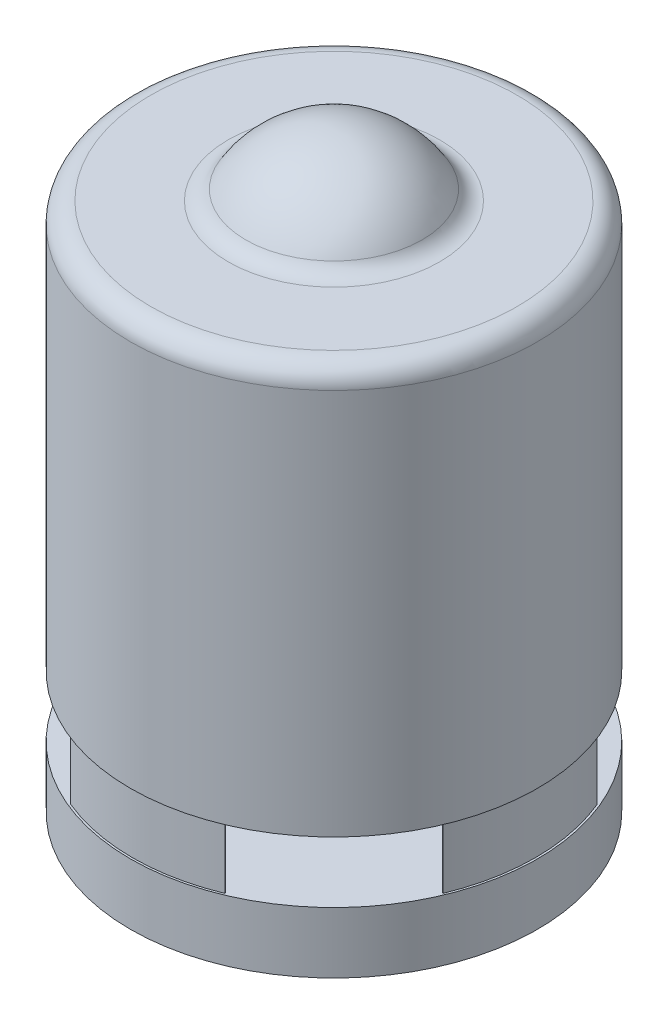
ISO-10303-21;
HEADER;
FILE_DESCRIPTION(('STEP AP214'),'2;1');
FILE_NAME('part.step','',(''),(''),'','','');
FILE_SCHEMA(('AUTOMOTIVE_DESIGN { 1 0 10303 214 1 1 1 1 }'));
ENDSEC;
DATA;
#1=APPLICATION_CONTEXT('core data for automotive mechanical design processes');
#2=APPLICATION_PROTOCOL_DEFINITION('international standard','automotive_design',2000,#1);
#3=PRODUCT_CONTEXT('',#1,'mechanical');
#4=PRODUCT('Part','Part','',(#3));
#5=PRODUCT_RELATED_PRODUCT_CATEGORY('part','',(#4));
#6=PRODUCT_DEFINITION_FORMATION('','',#4);
#7=PRODUCT_DEFINITION_CONTEXT('part definition',#1,'design');
#8=PRODUCT_DEFINITION('design','',#6,#7);
#9=PRODUCT_DEFINITION_SHAPE('','',#8);
#10=(LENGTH_UNIT() NAMED_UNIT(*) SI_UNIT(.MILLI.,.METRE.));
#11=(NAMED_UNIT(*) PLANE_ANGLE_UNIT() SI_UNIT($,.RADIAN.));
#12=(NAMED_UNIT(*) SI_UNIT($,.STERADIAN.) SOLID_ANGLE_UNIT());
#13=UNCERTAINTY_MEASURE_WITH_UNIT(LENGTH_MEASURE(1.E-05),#10,'distance_accuracy_value','');
#14=(GEOMETRIC_REPRESENTATION_CONTEXT(3) GLOBAL_UNCERTAINTY_ASSIGNED_CONTEXT((#13)) GLOBAL_UNIT_ASSIGNED_CONTEXT((#10,
#11,#12)) REPRESENTATION_CONTEXT('',''));
#15=CARTESIAN_POINT('',(0.,0.,0.));
#16=DIRECTION('',(0.,0.,1.));
#17=DIRECTION('',(1.,0.,0.));
#18=AXIS2_PLACEMENT_3D('',#15,#16,#17);
#19=CARTESIAN_POINT('',(0.,116.513033548159,0.));
#20=DIRECTION('',(0.,1.,0.));
#21=DIRECTION('',(0.,0.,1.));
#22=AXIS2_PLACEMENT_3D('',#19,#20,#21);
#23=PLANE('',#22);
#24=CARTESIAN_POINT('',(0.,116.513033548159,0.));
#25=DIRECTION('',(0.,1.,0.));
#26=DIRECTION('',(0.,0.,1.));
#27=AXIS2_PLACEMENT_3D('',#24,#25,#26);
#28=CIRCLE('',#27,23.3333333333333);
#29=CARTESIAN_POINT('',(0.,116.513033548159,23.3333333333333));
#30=VERTEX_POINT('',#29);
#31=EDGE_CURVE('E336',#30,#30,#28,.T.);
#32=ORIENTED_EDGE('',*,*,#31,.T.);
#33=EDGE_LOOP('',(#32));
#34=FACE_BOUND('',#33,.T.);
#35=DIRECTION('',(-0.923879532511296,0.,0.382683432365067));
#36=VECTOR('',#35,1.);
#37=CARTESIAN_POINT('',(21.3416172010107,116.513033548159,-8.83998728763359));
#38=LINE('',#37,#36);
#39=CARTESIAN_POINT('',(21.3416172010107,116.513033548159,-8.83998728763359));
#40=VERTEX_POINT('',#39);
#41=CARTESIAN_POINT('',(21.2338312555511,116.513033548159,-8.795340887191));
#42=VERTEX_POINT('',#41);
#43=EDGE_CURVE('E313',#40,#42,#38,.T.);
#44=ORIENTED_EDGE('',*,*,#43,.F.);
#45=CARTESIAN_POINT('',(0.,116.513033548159,0.));
#46=DIRECTION('',(0.,1.,0.));
#47=DIRECTION('',(0.,0.,-1.));
#48=AXIS2_PLACEMENT_3D('',#45,#46,#47);
#49=CIRCLE('',#48,23.1);
#50=CARTESIAN_POINT('',(21.3416172010108,116.513033548159,8.83998728763344));
#51=VERTEX_POINT('',#50);
#52=EDGE_CURVE('E291',#51,#40,#49,.T.);
#53=ORIENTED_EDGE('',*,*,#52,.F.);
#54=DIRECTION('',(0.923879532511282,0.,0.382683432365102));
#55=VECTOR('',#54,1.);
#56=CARTESIAN_POINT('',(21.3416172010108,116.513033548159,8.83998728763344));
#57=LINE('',#56,#55);
#58=CARTESIAN_POINT('',(21.2338312555511,116.513033548159,8.79534088719085));
#59=VERTEX_POINT('',#58);
#60=EDGE_CURVE('E297',#59,#51,#57,.T.);
#61=ORIENTED_EDGE('',*,*,#60,.F.);
#62=CARTESIAN_POINT('',(0.,116.513033548159,0.));
#63=DIRECTION('',(0.,-1.,0.));
#64=DIRECTION('',(0.,0.,-1.));
#65=AXIS2_PLACEMENT_3D('',#62,#63,#64);
#66=CIRCLE('',#65,22.9833333333333);
#67=EDGE_CURVE('E316',#42,#59,#66,.T.);
#68=ORIENTED_EDGE('',*,*,#67,.F.);
#69=EDGE_LOOP('',(#44,#53,#61,#68));
#70=FACE_BOUND('',#69,.T.);
#71=DIRECTION('',(-0.382683432365057,0.,-0.9238795325113));
#72=VECTOR('',#71,1.);
#73=CARTESIAN_POINT('',(8.83998728763351,116.513033548159,21.3416172010107));
#74=LINE('',#73,#72);
#75=CARTESIAN_POINT('',(8.83998728763351,116.513033548159,21.3416172010107));
#76=VERTEX_POINT('',#75);
#77=CARTESIAN_POINT('',(8.79534088719092,116.513033548159,21.2338312555511));
#78=VERTEX_POINT('',#77);
#79=EDGE_CURVE('E269',#76,#78,#74,.T.);
#80=ORIENTED_EDGE('',*,*,#79,.F.);
#81=CARTESIAN_POINT('',(0.,116.513033548159,0.));
#82=DIRECTION('',(0.,1.,0.));
#83=DIRECTION('',(0.,0.,-1.));
#84=AXIS2_PLACEMENT_3D('',#81,#82,#83);
#85=CIRCLE('',#84,23.1);
#86=CARTESIAN_POINT('',(-8.83998728763352,116.513033548159,21.3416172010107));
#87=VERTEX_POINT('',#86);
#88=EDGE_CURVE('E247',#87,#76,#85,.T.);
#89=ORIENTED_EDGE('',*,*,#88,.F.);
#90=DIRECTION('',(-0.382683432365112,0.,0.923879532511277));
#91=VECTOR('',#90,1.);
#92=CARTESIAN_POINT('',(-8.83998728763352,116.513033548159,21.3416172010107));
#93=LINE('',#92,#91);
#94=CARTESIAN_POINT('',(-8.79534088719092,116.513033548159,21.2338312555511));
#95=VERTEX_POINT('',#94);
#96=EDGE_CURVE('E253',#95,#87,#93,.T.);
#97=ORIENTED_EDGE('',*,*,#96,.F.);
#98=CARTESIAN_POINT('',(0.,116.513033548159,0.));
#99=DIRECTION('',(0.,-1.,0.));
#100=DIRECTION('',(0.,0.,-1.));
#101=AXIS2_PLACEMENT_3D('',#98,#99,#100);
#102=CIRCLE('',#101,22.9833333333333);
#103=EDGE_CURVE('E272',#78,#95,#102,.T.);
#104=ORIENTED_EDGE('',*,*,#103,.F.);
#105=EDGE_LOOP('',(#80,#89,#97,#104));
#106=FACE_BOUND('',#105,.T.);
#107=DIRECTION('',(0.923879532511296,0.,-0.382683432365067));
#108=VECTOR('',#107,1.);
#109=CARTESIAN_POINT('',(-21.3416172010108,116.513033548159,8.83998728763344));
#110=LINE('',#109,#108);
#111=CARTESIAN_POINT('',(-21.3416172010108,116.513033548159,8.83998728763344));
#112=VERTEX_POINT('',#111);
#113=CARTESIAN_POINT('',(-21.2338312555511,116.513033548159,8.79534088719085));
#114=VERTEX_POINT('',#113);
#115=EDGE_CURVE('E227',#112,#114,#110,.T.);
#116=ORIENTED_EDGE('',*,*,#115,.F.);
#117=CARTESIAN_POINT('',(0.,116.513033548159,0.));
#118=DIRECTION('',(0.,1.,0.));
#119=DIRECTION('',(0.,0.,-1.));
#120=AXIS2_PLACEMENT_3D('',#117,#118,#119);
#121=CIRCLE('',#120,23.1);
#122=CARTESIAN_POINT('',(-21.3416172010107,116.513033548159,-8.83998728763359));
#123=VERTEX_POINT('',#122);
#124=EDGE_CURVE('E205',#123,#112,#121,.T.);
#125=ORIENTED_EDGE('',*,*,#124,.F.);
#126=DIRECTION('',(-0.923879532511282,0.,-0.382683432365102));
#127=VECTOR('',#126,1.);
#128=CARTESIAN_POINT('',(-21.3416172010107,116.513033548159,-8.83998728763359));
#129=LINE('',#128,#127);
#130=CARTESIAN_POINT('',(-21.2338312555511,116.513033548159,-8.795340887191));
#131=VERTEX_POINT('',#130);
#132=EDGE_CURVE('E211',#131,#123,#129,.T.);
#133=ORIENTED_EDGE('',*,*,#132,.F.);
#134=CARTESIAN_POINT('',(0.,116.513033548159,0.));
#135=DIRECTION('',(0.,-1.,0.));
#136=DIRECTION('',(0.,0.,-1.));
#137=AXIS2_PLACEMENT_3D('',#134,#135,#136);
#138=CIRCLE('',#137,22.9833333333333);
#139=EDGE_CURVE('E230',#114,#131,#138,.T.);
#140=ORIENTED_EDGE('',*,*,#139,.F.);
#141=EDGE_LOOP('',(#116,#125,#133,#140));
#142=FACE_BOUND('',#141,.T.);
#143=DIRECTION('',(0.382683432365045,0.,0.923879532511305));
#144=VECTOR('',#143,1.);
#145=CARTESIAN_POINT('',(-8.83998728763337,116.513033548159,-21.3416172010108));
#146=LINE('',#145,#144);
#147=CARTESIAN_POINT('',(-8.83998728763337,116.513033548159,-21.3416172010108));
#148=VERTEX_POINT('',#147);
#149=CARTESIAN_POINT('',(-8.79534088719078,116.513033548159,-21.2338312555512));
#150=VERTEX_POINT('',#149);
#151=EDGE_CURVE('E188',#148,#150,#146,.T.);
#152=ORIENTED_EDGE('',*,*,#151,.F.);
#153=CARTESIAN_POINT('',(0.,116.513033548159,0.));
#154=DIRECTION('',(0.,1.,0.));
#155=DIRECTION('',(0.,0.,-1.));
#156=AXIS2_PLACEMENT_3D('',#153,#154,#155);
#157=CIRCLE('',#156,23.1);
#158=CARTESIAN_POINT('',(8.83998728763366,116.513033548159,-21.3416172010107));
#159=VERTEX_POINT('',#158);
#160=EDGE_CURVE('E185',#159,#148,#157,.T.);
#161=ORIENTED_EDGE('',*,*,#160,.F.);
#162=DIRECTION('',(0.382683432365124,0.,-0.923879532511272));
#163=VECTOR('',#162,1.);
#164=CARTESIAN_POINT('',(8.83998728763366,116.513033548159,-21.3416172010107));
#165=LINE('',#164,#163);
#166=CARTESIAN_POINT('',(8.79534088719107,116.513033548159,-21.233831255551));
#167=VERTEX_POINT('',#166);
#168=EDGE_CURVE('E167',#167,#159,#165,.T.);
#169=ORIENTED_EDGE('',*,*,#168,.F.);
#170=CARTESIAN_POINT('',(0.,116.513033548159,0.));
#171=DIRECTION('',(0.,-1.,0.));
#172=DIRECTION('',(0.,0.,-1.));
#173=AXIS2_PLACEMENT_3D('',#170,#171,#172);
#174=CIRCLE('',#173,22.9833333333333);
#175=EDGE_CURVE('E192',#150,#167,#174,.T.);
#176=ORIENTED_EDGE('',*,*,#175,.F.);
#177=EDGE_LOOP('',(#152,#161,#169,#176));
#178=FACE_BOUND('',#177,.T.);
#179=ADVANCED_FACE('F40',(#34,#70,#106,#142,#178),#23,.T.);
#180=CARTESIAN_POINT('',(0.,116.513033548159,0.));
#181=DIRECTION('',(0.,-1.,0.));
#182=DIRECTION('',(0.,0.,-1.));
#183=AXIS2_PLACEMENT_3D('',#180,#181,#182);
#184=CYLINDRICAL_SURFACE('',#183,23.3333333333333);
#185=ORIENTED_EDGE('',*,*,#31,.F.);
#186=EDGE_LOOP('',(#185));
#187=FACE_BOUND('',#186,.T.);
#188=CARTESIAN_POINT('',(0.,109.513033548159,0.));
#189=DIRECTION('',(0.,1.,0.));
#190=DIRECTION('',(0.,0.,1.));
#191=AXIS2_PLACEMENT_3D('',#188,#189,#190);
#192=CIRCLE('',#191,23.3333333333333);
#193=CARTESIAN_POINT('',(0.,109.513033548159,23.3333333333333));
#194=VERTEX_POINT('',#193);
#195=EDGE_CURVE('E335',#194,#194,#192,.T.);
#196=ORIENTED_EDGE('',*,*,#195,.T.);
#197=EDGE_LOOP('',(#196));
#198=FACE_BOUND('',#197,.T.);
#199=ADVANCED_FACE('F378',(#187,#198),#184,.T.);
#200=CARTESIAN_POINT('',(0.,109.513033548159,0.));
#201=DIRECTION('',(0.,1.,0.));
#202=DIRECTION('',(0.,0.,1.));
#203=AXIS2_PLACEMENT_3D('',#200,#201,#202);
#204=PLANE('',#203);
#205=ORIENTED_EDGE('',*,*,#195,.F.);
#206=EDGE_LOOP('',(#205));
#207=FACE_BOUND('',#206,.T.);
#208=ADVANCED_FACE('F384',(#207),#204,.F.);
#209=CARTESIAN_POINT('',(0.,123.513033548159,0.));
#210=DIRECTION('',(0.,-1.,0.));
#211=DIRECTION('',(0.,0.,-1.));
#212=AXIS2_PLACEMENT_3D('',#209,#210,#211);
#213=CYLINDRICAL_SURFACE('',#212,23.1);
#214=ORIENTED_EDGE('',*,*,#52,.T.);
#215=DIRECTION('',(0.,-1.,0.));
#216=VECTOR('',#215,1.);
#217=CARTESIAN_POINT('',(21.3416172010107,123.513033548159,-8.83998728763359));
#218=LINE('',#217,#216);
#219=CARTESIAN_POINT('',(21.3416172010107,123.513033548159,-8.83998728763359));
#220=VERTEX_POINT('',#219);
#221=EDGE_CURVE('E332',#220,#40,#218,.T.);
#222=ORIENTED_EDGE('',*,*,#221,.F.);
#223=CARTESIAN_POINT('',(0.,123.513033548159,0.));
#224=DIRECTION('',(0.,1.,0.));
#225=DIRECTION('',(0.,0.,-1.));
#226=AXIS2_PLACEMENT_3D('',#223,#224,#225);
#227=CIRCLE('',#226,23.1);
#228=CARTESIAN_POINT('',(21.3416172010108,123.513033548159,8.83998728763344));
#229=VERTEX_POINT('',#228);
#230=EDGE_CURVE('E292',#229,#220,#227,.T.);
#231=ORIENTED_EDGE('',*,*,#230,.F.);
#232=DIRECTION('',(0.,-1.,0.));
#233=VECTOR('',#232,1.);
#234=CARTESIAN_POINT('',(21.3416172010108,123.513033548159,8.83998728763344));
#235=LINE('',#234,#233);
#236=EDGE_CURVE('E309',#229,#51,#235,.T.);
#237=ORIENTED_EDGE('',*,*,#236,.T.);
#238=EDGE_LOOP('',(#214,#222,#231,#237));
#239=FACE_BOUND('',#238,.T.);
#240=ADVANCED_FACE('F390',(#239),#213,.T.);
#241=CARTESIAN_POINT('',(21.3416172010107,123.513033548159,-8.83998728763359));
#242=DIRECTION('',(0.382683432365067,0.,0.923879532511296));
#243=DIRECTION('',(0.923879532511296,0.,-0.382683432365067));
#244=AXIS2_PLACEMENT_3D('',#241,#242,#243);
#245=PLANE('',#244);
#246=ORIENTED_EDGE('',*,*,#43,.T.);
#247=DIRECTION('',(0.,-1.,0.));
#248=VECTOR('',#247,1.);
#249=CARTESIAN_POINT('',(21.2338312555511,123.513033548159,-8.795340887191));
#250=LINE('',#249,#248);
#251=CARTESIAN_POINT('',(21.2338312555511,123.513033548159,-8.795340887191));
#252=VERTEX_POINT('',#251);
#253=EDGE_CURVE('E328',#252,#42,#250,.T.);
#254=ORIENTED_EDGE('',*,*,#253,.F.);
#255=DIRECTION('',(-0.923879532511296,0.,0.382683432365067));
#256=VECTOR('',#255,1.);
#257=CARTESIAN_POINT('',(21.3416172010107,123.513033548159,-8.83998728763359));
#258=LINE('',#257,#256);
#259=EDGE_CURVE('E296',#220,#252,#258,.T.);
#260=ORIENTED_EDGE('',*,*,#259,.F.);
#261=ORIENTED_EDGE('',*,*,#221,.T.);
#262=EDGE_LOOP('',(#246,#254,#260,#261));
#263=FACE_BOUND('',#262,.T.);
#264=ADVANCED_FACE('F397',(#263),#245,.F.);
#265=CARTESIAN_POINT('',(0.,123.513033548159,0.));
#266=DIRECTION('',(0.,-1.,0.));
#267=DIRECTION('',(0.,0.,-1.));
#268=AXIS2_PLACEMENT_3D('',#265,#266,#267);
#269=CYLINDRICAL_SURFACE('',#268,22.9833333333333);
#270=ORIENTED_EDGE('',*,*,#67,.T.);
#271=DIRECTION('',(0.,-1.,0.));
#272=VECTOR('',#271,1.);
#273=CARTESIAN_POINT('',(21.2338312555511,123.513033548159,8.79534088719084));
#274=LINE('',#273,#272);
#275=CARTESIAN_POINT('',(21.2338312555511,123.513033548159,8.79534088719084));
#276=VERTEX_POINT('',#275);
#277=EDGE_CURVE('E325',#276,#59,#274,.T.);
#278=ORIENTED_EDGE('',*,*,#277,.F.);
#279=CARTESIAN_POINT('',(0.,123.513033548159,0.));
#280=DIRECTION('',(0.,-1.,0.));
#281=DIRECTION('',(0.,0.,-1.));
#282=AXIS2_PLACEMENT_3D('',#279,#280,#281);
#283=CIRCLE('',#282,22.9833333333333);
#284=EDGE_CURVE('E301',#252,#276,#283,.T.);
#285=ORIENTED_EDGE('',*,*,#284,.F.);
#286=ORIENTED_EDGE('',*,*,#253,.T.);
#287=EDGE_LOOP('',(#270,#278,#285,#286));
#288=FACE_BOUND('',#287,.T.);
#289=ADVANCED_FACE('F404',(#288),#269,.F.);
#290=CARTESIAN_POINT('',(21.3416172010108,123.513033548159,8.83998728763344));
#291=DIRECTION('',(0.382683432365102,0.,-0.923879532511281));
#292=DIRECTION('',(-0.923879532511282,0.,-0.382683432365103));
#293=AXIS2_PLACEMENT_3D('',#290,#291,#292);
#294=PLANE('',#293);
#295=ORIENTED_EDGE('',*,*,#60,.T.);
#296=ORIENTED_EDGE('',*,*,#236,.F.);
#297=DIRECTION('',(0.923879532511282,0.,0.382683432365102));
#298=VECTOR('',#297,1.);
#299=CARTESIAN_POINT('',(21.3416172010108,123.513033548159,8.83998728763344));
#300=LINE('',#299,#298);
#301=EDGE_CURVE('E305',#276,#229,#300,.T.);
#302=ORIENTED_EDGE('',*,*,#301,.F.);
#303=ORIENTED_EDGE('',*,*,#277,.T.);
#304=EDGE_LOOP('',(#295,#296,#302,#303));
#305=FACE_BOUND('',#304,.T.);
#306=ADVANCED_FACE('F418',(#305),#294,.F.);
#307=CARTESIAN_POINT('',(0.,123.513033548159,0.));
#308=DIRECTION('',(0.,-1.,0.));
#309=DIRECTION('',(0.,0.,-1.));
#310=AXIS2_PLACEMENT_3D('',#307,#308,#309);
#311=CYLINDRICAL_SURFACE('',#310,23.1);
#312=ORIENTED_EDGE('',*,*,#88,.T.);
#313=DIRECTION('',(0.,-1.,0.));
#314=VECTOR('',#313,1.);
#315=CARTESIAN_POINT('',(8.83998728763351,123.513033548159,21.3416172010107));
#316=LINE('',#315,#314);
#317=CARTESIAN_POINT('',(8.83998728763351,123.513033548159,21.3416172010107));
#318=VERTEX_POINT('',#317);
#319=EDGE_CURVE('E288',#318,#76,#316,.T.);
#320=ORIENTED_EDGE('',*,*,#319,.F.);
#321=CARTESIAN_POINT('',(0.,123.513033548159,0.));
#322=DIRECTION('',(0.,1.,0.));
#323=DIRECTION('',(0.,0.,-1.));
#324=AXIS2_PLACEMENT_3D('',#321,#322,#323);
#325=CIRCLE('',#324,23.1);
#326=CARTESIAN_POINT('',(-8.83998728763352,123.513033548159,21.3416172010107));
#327=VERTEX_POINT('',#326);
#328=EDGE_CURVE('E248',#327,#318,#325,.T.);
#329=ORIENTED_EDGE('',*,*,#328,.F.);
#330=DIRECTION('',(0.,-1.,0.));
#331=VECTOR('',#330,1.);
#332=CARTESIAN_POINT('',(-8.83998728763352,123.513033548159,21.3416172010107));
#333=LINE('',#332,#331);
#334=EDGE_CURVE('E265',#327,#87,#333,.T.);
#335=ORIENTED_EDGE('',*,*,#334,.T.);
#336=EDGE_LOOP('',(#312,#320,#329,#335));
#337=FACE_BOUND('',#336,.T.);
#338=ADVANCED_FACE('F420',(#337),#311,.T.);
#339=CARTESIAN_POINT('',(8.83998728763351,123.513033548159,21.3416172010107));
#340=DIRECTION('',(-0.9238795325113,0.,0.382683432365057));
#341=DIRECTION('',(0.382683432365057,0.,0.9238795325113));
#342=AXIS2_PLACEMENT_3D('',#339,#340,#341);
#343=PLANE('',#342);
#344=ORIENTED_EDGE('',*,*,#79,.T.);
#345=DIRECTION('',(0.,-1.,0.));
#346=VECTOR('',#345,1.);
#347=CARTESIAN_POINT('',(8.79534088719092,123.513033548159,21.2338312555511));
#348=LINE('',#347,#346);
#349=CARTESIAN_POINT('',(8.79534088719092,123.513033548159,21.2338312555511));
#350=VERTEX_POINT('',#349);
#351=EDGE_CURVE('E284',#350,#78,#348,.T.);
#352=ORIENTED_EDGE('',*,*,#351,.F.);
#353=DIRECTION('',(-0.382683432365057,0.,-0.9238795325113));
#354=VECTOR('',#353,1.);
#355=CARTESIAN_POINT('',(8.83998728763351,123.513033548159,21.3416172010107));
#356=LINE('',#355,#354);
#357=EDGE_CURVE('E252',#318,#350,#356,.T.);
#358=ORIENTED_EDGE('',*,*,#357,.F.);
#359=ORIENTED_EDGE('',*,*,#319,.T.);
#360=EDGE_LOOP('',(#344,#352,#358,#359));
#361=FACE_BOUND('',#360,.T.);
#362=ADVANCED_FACE('F426',(#361),#343,.F.);
#363=CARTESIAN_POINT('',(0.,123.513033548159,0.));
#364=DIRECTION('',(0.,-1.,0.));
#365=DIRECTION('',(0.,0.,-1.));
#366=AXIS2_PLACEMENT_3D('',#363,#364,#365);
#367=CYLINDRICAL_SURFACE('',#366,22.9833333333333);
#368=ORIENTED_EDGE('',*,*,#103,.T.);
#369=DIRECTION('',(0.,-1.,0.));
#370=VECTOR('',#369,1.);
#371=CARTESIAN_POINT('',(-8.79534088719092,123.513033548159,21.2338312555511));
#372=LINE('',#371,#370);
#373=CARTESIAN_POINT('',(-8.79534088719092,123.513033548159,21.2338312555511));
#374=VERTEX_POINT('',#373);
#375=EDGE_CURVE('E281',#374,#95,#372,.T.);
#376=ORIENTED_EDGE('',*,*,#375,.F.);
#377=CARTESIAN_POINT('',(0.,123.513033548159,0.));
#378=DIRECTION('',(0.,-1.,0.));
#379=DIRECTION('',(0.,0.,-1.));
#380=AXIS2_PLACEMENT_3D('',#377,#378,#379);
#381=CIRCLE('',#380,22.9833333333333);
#382=EDGE_CURVE('E257',#350,#374,#381,.T.);
#383=ORIENTED_EDGE('',*,*,#382,.F.);
#384=ORIENTED_EDGE('',*,*,#351,.T.);
#385=EDGE_LOOP('',(#368,#376,#383,#384));
#386=FACE_BOUND('',#385,.T.);
#387=ADVANCED_FACE('F433',(#386),#367,.F.);
#388=CARTESIAN_POINT('',(-8.83998728763352,123.513033548159,21.3416172010107));
#389=DIRECTION('',(0.923879532511277,0.,0.382683432365112));
#390=DIRECTION('',(0.382683432365112,0.,-0.923879532511277));
#391=AXIS2_PLACEMENT_3D('',#388,#389,#390);
#392=PLANE('',#391);
#393=ORIENTED_EDGE('',*,*,#96,.T.);
#394=ORIENTED_EDGE('',*,*,#334,.F.);
#395=DIRECTION('',(-0.382683432365112,0.,0.923879532511277));
#396=VECTOR('',#395,1.);
#397=CARTESIAN_POINT('',(-8.83998728763352,123.513033548159,21.3416172010107));
#398=LINE('',#397,#396);
#399=EDGE_CURVE('E261',#374,#327,#398,.T.);
#400=ORIENTED_EDGE('',*,*,#399,.F.);
#401=ORIENTED_EDGE('',*,*,#375,.T.);
#402=EDGE_LOOP('',(#393,#394,#400,#401));
#403=FACE_BOUND('',#402,.T.);
#404=ADVANCED_FACE('F437',(#403),#392,.F.);
#405=CARTESIAN_POINT('',(0.,123.513033548159,0.));
#406=DIRECTION('',(0.,-1.,0.));
#407=DIRECTION('',(0.,0.,-1.));
#408=AXIS2_PLACEMENT_3D('',#405,#406,#407);
#409=CYLINDRICAL_SURFACE('',#408,23.1);
#410=ORIENTED_EDGE('',*,*,#124,.T.);
#411=DIRECTION('',(0.,-1.,0.));
#412=VECTOR('',#411,1.);
#413=CARTESIAN_POINT('',(-21.3416172010108,123.513033548159,8.83998728763344));
#414=LINE('',#413,#412);
#415=CARTESIAN_POINT('',(-21.3416172010108,123.513033548159,8.83998728763344));
#416=VERTEX_POINT('',#415);
#417=EDGE_CURVE('E244',#416,#112,#414,.T.);
#418=ORIENTED_EDGE('',*,*,#417,.F.);
#419=CARTESIAN_POINT('',(0.,123.513033548159,0.));
#420=DIRECTION('',(0.,1.,0.));
#421=DIRECTION('',(0.,0.,-1.));
#422=AXIS2_PLACEMENT_3D('',#419,#420,#421);
#423=CIRCLE('',#422,23.1);
#424=CARTESIAN_POINT('',(-21.3416172010107,123.513033548159,-8.83998728763359));
#425=VERTEX_POINT('',#424);
#426=EDGE_CURVE('E206',#425,#416,#423,.T.);
#427=ORIENTED_EDGE('',*,*,#426,.F.);
#428=DIRECTION('',(0.,-1.,0.));
#429=VECTOR('',#428,1.);
#430=CARTESIAN_POINT('',(-21.3416172010107,123.513033548159,-8.83998728763359));
#431=LINE('',#430,#429);
#432=EDGE_CURVE('E223',#425,#123,#431,.T.);
#433=ORIENTED_EDGE('',*,*,#432,.T.);
#434=EDGE_LOOP('',(#410,#418,#427,#433));
#435=FACE_BOUND('',#434,.T.);
#436=ADVANCED_FACE('F441',(#435),#409,.T.);
#437=CARTESIAN_POINT('',(-21.3416172010108,123.513033548159,8.83998728763344));
#438=DIRECTION('',(-0.382683432365067,0.,-0.923879532511296));
#439=DIRECTION('',(-0.923879532511296,0.,0.382683432365067));
#440=AXIS2_PLACEMENT_3D('',#437,#438,#439);
#441=PLANE('',#440);
#442=ORIENTED_EDGE('',*,*,#115,.T.);
#443=DIRECTION('',(0.,-1.,0.));
#444=VECTOR('',#443,1.);
#445=CARTESIAN_POINT('',(-21.2338312555511,123.513033548159,8.79534088719085));
#446=LINE('',#445,#444);
#447=CARTESIAN_POINT('',(-21.2338312555511,123.513033548159,8.79534088719085));
#448=VERTEX_POINT('',#447);
#449=EDGE_CURVE('E240',#448,#114,#446,.T.);
#450=ORIENTED_EDGE('',*,*,#449,.F.);
#451=DIRECTION('',(0.923879532511296,0.,-0.382683432365067));
#452=VECTOR('',#451,1.);
#453=CARTESIAN_POINT('',(-21.3416172010108,123.513033548159,8.83998728763344));
#454=LINE('',#453,#452);
#455=EDGE_CURVE('E210',#416,#448,#454,.T.);
#456=ORIENTED_EDGE('',*,*,#455,.F.);
#457=ORIENTED_EDGE('',*,*,#417,.T.);
#458=EDGE_LOOP('',(#442,#450,#456,#457));
#459=FACE_BOUND('',#458,.T.);
#460=ADVANCED_FACE('F445',(#459),#441,.F.);
#461=CARTESIAN_POINT('',(0.,123.513033548159,0.));
#462=DIRECTION('',(0.,-1.,0.));
#463=DIRECTION('',(0.,0.,-1.));
#464=AXIS2_PLACEMENT_3D('',#461,#462,#463);
#465=CYLINDRICAL_SURFACE('',#464,22.9833333333333);
#466=ORIENTED_EDGE('',*,*,#139,.T.);
#467=DIRECTION('',(0.,-1.,0.));
#468=VECTOR('',#467,1.);
#469=CARTESIAN_POINT('',(-21.2338312555511,123.513033548159,-8.79534088719099));
#470=LINE('',#469,#468);
#471=CARTESIAN_POINT('',(-21.2338312555511,123.513033548159,-8.79534088719099));
#472=VERTEX_POINT('',#471);
#473=EDGE_CURVE('E64',#472,#131,#470,.T.);
#474=ORIENTED_EDGE('',*,*,#473,.F.);
#475=CARTESIAN_POINT('',(0.,123.513033548159,0.));
#476=DIRECTION('',(0.,-1.,0.));
#477=DIRECTION('',(0.,0.,-1.));
#478=AXIS2_PLACEMENT_3D('',#475,#476,#477);
#479=CIRCLE('',#478,22.9833333333333);
#480=EDGE_CURVE('E215',#448,#472,#479,.T.);
#481=ORIENTED_EDGE('',*,*,#480,.F.);
#482=ORIENTED_EDGE('',*,*,#449,.T.);
#483=EDGE_LOOP('',(#466,#474,#481,#482));
#484=FACE_BOUND('',#483,.T.);
#485=ADVANCED_FACE('F449',(#484),#465,.F.);
#486=CARTESIAN_POINT('',(-21.3416172010107,123.513033548159,-8.83998728763359));
#487=DIRECTION('',(-0.382683432365102,0.,0.923879532511281));
#488=DIRECTION('',(0.923879532511282,0.,0.382683432365103));
#489=AXIS2_PLACEMENT_3D('',#486,#487,#488);
#490=PLANE('',#489);
#491=ORIENTED_EDGE('',*,*,#132,.T.);
#492=ORIENTED_EDGE('',*,*,#432,.F.);
#493=DIRECTION('',(-0.923879532511282,0.,-0.382683432365102));
#494=VECTOR('',#493,1.);
#495=CARTESIAN_POINT('',(-21.3416172010107,123.513033548159,-8.83998728763359));
#496=LINE('',#495,#494);
#497=EDGE_CURVE('E219',#472,#425,#496,.T.);
#498=ORIENTED_EDGE('',*,*,#497,.F.);
#499=ORIENTED_EDGE('',*,*,#473,.T.);
#500=EDGE_LOOP('',(#491,#492,#498,#499));
#501=FACE_BOUND('',#500,.T.);
#502=ADVANCED_FACE('F453',(#501),#490,.F.);
#503=CARTESIAN_POINT('',(0.,123.513033548159,0.));
#504=DIRECTION('',(0.,-1.,0.));
#505=DIRECTION('',(0.,0.,-1.));
#506=AXIS2_PLACEMENT_3D('',#503,#504,#505);
#507=CYLINDRICAL_SURFACE('',#506,23.1);
#508=ORIENTED_EDGE('',*,*,#160,.T.);
#509=DIRECTION('',(0.,-1.,0.));
#510=VECTOR('',#509,1.);
#511=CARTESIAN_POINT('',(-8.83998728763337,123.513033548159,-21.3416172010108));
#512=LINE('',#511,#510);
#513=CARTESIAN_POINT('',(-8.83998728763337,123.513033548159,-21.3416172010108));
#514=VERTEX_POINT('',#513);
#515=EDGE_CURVE('E161',#514,#148,#512,.T.);
#516=ORIENTED_EDGE('',*,*,#515,.F.);
#517=CARTESIAN_POINT('',(0.,123.513033548159,0.));
#518=DIRECTION('',(0.,1.,0.));
#519=DIRECTION('',(0.,0.,-1.));
#520=AXIS2_PLACEMENT_3D('',#517,#518,#519);
#521=CIRCLE('',#520,23.1);
#522=CARTESIAN_POINT('',(8.83998728763366,123.513033548159,-21.3416172010107));
#523=VERTEX_POINT('',#522);
#524=EDGE_CURVE('E155',#523,#514,#521,.T.);
#525=ORIENTED_EDGE('',*,*,#524,.F.);
#526=DIRECTION('',(0.,-1.,0.));
#527=VECTOR('',#526,1.);
#528=CARTESIAN_POINT('',(8.83998728763366,123.513033548159,-21.3416172010107));
#529=LINE('',#528,#527);
#530=EDGE_CURVE('E159',#523,#159,#529,.T.);
#531=ORIENTED_EDGE('',*,*,#530,.T.);
#532=EDGE_LOOP('',(#508,#516,#525,#531));
#533=FACE_BOUND('',#532,.T.);
#534=ADVANCED_FACE('F158',(#533),#507,.T.);
#535=CARTESIAN_POINT('',(-8.83998728763337,123.513033548159,-21.3416172010108));
#536=DIRECTION('',(0.923879532511305,0.,-0.382683432365045));
#537=DIRECTION('',(-0.382683432365045,0.,-0.923879532511305));
#538=AXIS2_PLACEMENT_3D('',#535,#536,#537);
#539=PLANE('',#538);
#540=ORIENTED_EDGE('',*,*,#151,.T.);
#541=DIRECTION('',(0.,-1.,0.));
#542=VECTOR('',#541,1.);
#543=CARTESIAN_POINT('',(-8.79534088719078,123.513033548159,-21.2338312555512));
#544=LINE('',#543,#542);
#545=CARTESIAN_POINT('',(-8.79534088719078,123.513033548159,-21.2338312555512));
#546=VERTEX_POINT('',#545);
#547=EDGE_CURVE('E199',#546,#150,#544,.T.);
#548=ORIENTED_EDGE('',*,*,#547,.F.);
#549=DIRECTION('',(0.382683432365045,0.,0.923879532511305));
#550=VECTOR('',#549,1.);
#551=CARTESIAN_POINT('',(-8.83998728763337,123.513033548159,-21.3416172010108));
#552=LINE('',#551,#550);
#553=EDGE_CURVE('E166',#514,#546,#552,.T.);
#554=ORIENTED_EDGE('',*,*,#553,.F.);
#555=ORIENTED_EDGE('',*,*,#515,.T.);
#556=EDGE_LOOP('',(#540,#548,#554,#555));
#557=FACE_BOUND('',#556,.T.);
#558=ADVANCED_FACE('F459',(#557),#539,.F.);
#559=CARTESIAN_POINT('',(0.,123.513033548159,0.));
#560=DIRECTION('',(0.,-1.,0.));
#561=DIRECTION('',(0.,0.,-1.));
#562=AXIS2_PLACEMENT_3D('',#559,#560,#561);
#563=CYLINDRICAL_SURFACE('',#562,22.9833333333333);
#564=ORIENTED_EDGE('',*,*,#175,.T.);
#565=DIRECTION('',(0.,-1.,0.));
#566=VECTOR('',#565,1.);
#567=CARTESIAN_POINT('',(8.79534088719106,123.513033548159,-21.233831255551));
#568=LINE('',#567,#566);
#569=CARTESIAN_POINT('',(8.79534088719106,123.513033548159,-21.233831255551));
#570=VERTEX_POINT('',#569);
#571=EDGE_CURVE('E56',#570,#167,#568,.T.);
#572=ORIENTED_EDGE('',*,*,#571,.F.);
#573=CARTESIAN_POINT('',(0.,123.513033548159,0.));
#574=DIRECTION('',(0.,-1.,0.));
#575=DIRECTION('',(0.,0.,-1.));
#576=AXIS2_PLACEMENT_3D('',#573,#574,#575);
#577=CIRCLE('',#576,22.9833333333333);
#578=EDGE_CURVE('E178',#546,#570,#577,.T.);
#579=ORIENTED_EDGE('',*,*,#578,.F.);
#580=ORIENTED_EDGE('',*,*,#547,.T.);
#581=EDGE_LOOP('',(#564,#572,#579,#580));
#582=FACE_BOUND('',#581,.T.);
#583=ADVANCED_FACE('F462',(#582),#563,.F.);
#584=CARTESIAN_POINT('',(8.83998728763366,123.513033548159,-21.3416172010107));
#585=DIRECTION('',(-0.923879532511272,0.,-0.382683432365124));
#586=DIRECTION('',(-0.382683432365124,0.,0.923879532511273));
#587=AXIS2_PLACEMENT_3D('',#584,#585,#586);
#588=PLANE('',#587);
#589=ORIENTED_EDGE('',*,*,#168,.T.);
#590=ORIENTED_EDGE('',*,*,#530,.F.);
#591=DIRECTION('',(0.382683432365124,0.,-0.923879532511272));
#592=VECTOR('',#591,1.);
#593=CARTESIAN_POINT('',(8.83998728763366,123.513033548159,-21.3416172010107));
#594=LINE('',#593,#592);
#595=EDGE_CURVE('E170',#570,#523,#594,.T.);
#596=ORIENTED_EDGE('',*,*,#595,.F.);
#597=ORIENTED_EDGE('',*,*,#571,.T.);
#598=EDGE_LOOP('',(#589,#590,#596,#597));
#599=FACE_BOUND('',#598,.T.);
#600=ADVANCED_FACE('F169',(#599),#588,.F.);
#601=CARTESIAN_POINT('',(0.,123.513033548159,0.));
#602=DIRECTION('',(0.,1.,0.));
#603=DIRECTION('',(0.,0.,1.));
#604=AXIS2_PLACEMENT_3D('',#601,#602,#603);
#605=PLANE('',#604);
#606=CARTESIAN_POINT('',(0.,123.513033548159,0.));
#607=DIRECTION('',(0.,1.,0.));
#608=DIRECTION('',(0.,0.,1.));
#609=AXIS2_PLACEMENT_3D('',#606,#607,#608);
#610=CIRCLE('',#609,23.3333333333333);
#611=CARTESIAN_POINT('',(0.,123.513033548159,23.3333333333333));
#612=VERTEX_POINT('',#611);
#613=EDGE_CURVE('E189',#612,#612,#610,.T.);
#614=ORIENTED_EDGE('',*,*,#613,.F.);
#615=EDGE_LOOP('',(#614));
#616=FACE_BOUND('',#615,.T.);
#617=ORIENTED_EDGE('',*,*,#595,.T.);
#618=ORIENTED_EDGE('',*,*,#524,.T.);
#619=ORIENTED_EDGE('',*,*,#553,.T.);
#620=ORIENTED_EDGE('',*,*,#578,.T.);
#621=EDGE_LOOP('',(#617,#618,#619,#620));
#622=FACE_BOUND('',#621,.T.);
#623=ORIENTED_EDGE('',*,*,#497,.T.);
#624=ORIENTED_EDGE('',*,*,#426,.T.);
#625=ORIENTED_EDGE('',*,*,#455,.T.);
#626=ORIENTED_EDGE('',*,*,#480,.T.);
#627=EDGE_LOOP('',(#623,#624,#625,#626));
#628=FACE_BOUND('',#627,.T.);
#629=ORIENTED_EDGE('',*,*,#399,.T.);
#630=ORIENTED_EDGE('',*,*,#328,.T.);
#631=ORIENTED_EDGE('',*,*,#357,.T.);
#632=ORIENTED_EDGE('',*,*,#382,.T.);
#633=EDGE_LOOP('',(#629,#630,#631,#632));
#634=FACE_BOUND('',#633,.T.);
#635=ORIENTED_EDGE('',*,*,#301,.T.);
#636=ORIENTED_EDGE('',*,*,#230,.T.);
#637=ORIENTED_EDGE('',*,*,#259,.T.);
#638=ORIENTED_EDGE('',*,*,#284,.T.);
#639=EDGE_LOOP('',(#635,#636,#637,#638));
#640=FACE_BOUND('',#639,.T.);
#641=ADVANCED_FACE('F175',(#616,#622,#628,#634,#640),#605,.F.);
#642=CARTESIAN_POINT('',(0.,170.179700214826,0.));
#643=DIRECTION('',(0.,-1.,0.));
#644=DIRECTION('',(0.,0.,-1.));
#645=AXIS2_PLACEMENT_3D('',#642,#643,#644);
#646=CYLINDRICAL_SURFACE('',#645,23.3333333333333);
#647=CARTESIAN_POINT('',(0.,167.846366881492,0.));
#648=DIRECTION('',(0.,1.,0.));
#649=DIRECTION('',(0.,0.,1.));
#650=AXIS2_PLACEMENT_3D('',#647,#648,#649);
#651=CIRCLE('',#650,23.3333333333333);
#652=CARTESIAN_POINT('',(0.,167.846366881492,23.3333333333333));
#653=VERTEX_POINT('',#652);
#654=EDGE_CURVE('E49',#653,#653,#651,.F.);
#655=ORIENTED_EDGE('',*,*,#654,.T.);
#656=EDGE_LOOP('',(#655));
#657=FACE_BOUND('',#656,.T.);
#658=ORIENTED_EDGE('',*,*,#613,.T.);
#659=EDGE_LOOP('',(#658));
#660=FACE_BOUND('',#659,.T.);
#661=ADVANCED_FACE('F354',(#657,#660),#646,.T.);
#662=CARTESIAN_POINT('',(0.,170.179700214826,0.));
#663=DIRECTION('',(0.,1.,0.));
#664=DIRECTION('',(0.,0.,1.));
#665=AXIS2_PLACEMENT_3D('',#662,#663,#664);
#666=PLANE('',#665);
#667=CARTESIAN_POINT('',(0.,170.179700214826,0.));
#668=DIRECTION('',(0.,1.,0.));
#669=DIRECTION('',(0.,0.,1.));
#670=AXIS2_PLACEMENT_3D('',#667,#668,#669);
#671=CIRCLE('',#670,21.);
#672=CARTESIAN_POINT('',(0.,170.179700214826,21.));
#673=VERTEX_POINT('',#672);
#674=EDGE_CURVE('E347',#673,#673,#671,.T.);
#675=ORIENTED_EDGE('',*,*,#674,.T.);
#676=EDGE_LOOP('',(#675));
#677=FACE_BOUND('',#676,.T.);
#678=CARTESIAN_POINT('',(0.,170.179700214826,0.));
#679=DIRECTION('',(0.,1.,0.));
#680=DIRECTION('',(0.,0.,1.));
#681=AXIS2_PLACEMENT_3D('',#678,#679,#680);
#682=CIRCLE('',#681,12.1243556529821);
#683=CARTESIAN_POINT('',(0.,170.179700214826,12.1243556529821));
#684=VERTEX_POINT('',#683);
#685=EDGE_CURVE('E340',#684,#684,#682,.F.);
#686=ORIENTED_EDGE('',*,*,#685,.T.);
#687=EDGE_LOOP('',(#686));
#688=FACE_BOUND('',#687,.T.);
#689=ADVANCED_FACE('F363',(#677,#688),#666,.T.);
#690=CARTESIAN_POINT('',(0.,165.513033548159,0.));
#691=DIRECTION('',(0.,-1.,0.));
#692=DIRECTION('',(1.,0.,0.));
#693=AXIS2_PLACEMENT_3D('',#690,#691,#692);
#694=SPHERICAL_SURFACE('',#693,11.6666666666667);
#695=CARTESIAN_POINT('',(0.,171.346366881492,0.));
#696=DIRECTION('',(0.,-1.,0.));
#697=DIRECTION('',(0.,0.,-1.));
#698=AXIS2_PLACEMENT_3D('',#695,#696,#697);
#699=CIRCLE('',#698,10.1036297108184);
#700=CARTESIAN_POINT('',(0.,171.346366881492,-10.1036297108184));
#701=VERTEX_POINT('',#700);
#702=EDGE_CURVE('E11',#701,#701,#699,.F.);
#703=ORIENTED_EDGE('',*,*,#702,.T.);
#704=EDGE_LOOP('',(#703));
#705=FACE_BOUND('',#704,.T.);
#706=ADVANCED_FACE('F360',(#705),#694,.T.);
#707=CARTESIAN_POINT('',(0.,167.846366881492,0.));
#708=DIRECTION('',(0.,1.,0.));
#709=DIRECTION('',(0.,0.,1.));
#710=AXIS2_PLACEMENT_3D('',#707,#708,#709);
#711=TOROIDAL_SURFACE('',#710,21.,2.33333333333333);
#712=ORIENTED_EDGE('',*,*,#654,.F.);
#713=EDGE_LOOP('',(#712));
#714=FACE_BOUND('',#713,.T.);
#715=ORIENTED_EDGE('',*,*,#674,.F.);
#716=EDGE_LOOP('',(#715));
#717=FACE_BOUND('',#716,.T.);
#718=ADVANCED_FACE('F357',(#714,#717),#711,.T.);
#719=CARTESIAN_POINT('',(0.,172.513033548159,0.));
#720=DIRECTION('',(0.,1.,0.));
#721=DIRECTION('',(0.,0.,1.));
#722=AXIS2_PLACEMENT_3D('',#719,#720,#721);
#723=TOROIDAL_SURFACE('',#722,12.1243556529821,2.33333333333333);
#724=ORIENTED_EDGE('',*,*,#685,.F.);
#725=EDGE_LOOP('',(#724));
#726=FACE_BOUND('',#725,.T.);
#727=ORIENTED_EDGE('',*,*,#702,.F.);
#728=EDGE_LOOP('',(#727));
#729=FACE_BOUND('',#728,.T.);
#730=ADVANCED_FACE('F42',(#726,#729),#723,.F.);
#731=CLOSED_SHELL('',(#179,#199,#208,#240,#264,#289,#306,#338,#362,#387,#404,#436,#460,#485,
#502,#534,#558,#583,#600,#641,#661,#689,#706,#718,#730));
#732=MANIFOLD_SOLID_BREP('B2',#731);
#733=ADVANCED_BREP_SHAPE_REPRESENTATION('',(#18,#732),#14);
#734=SHAPE_DEFINITION_REPRESENTATION(#9,#733);
ENDSEC;
END-ISO-10303-21;
